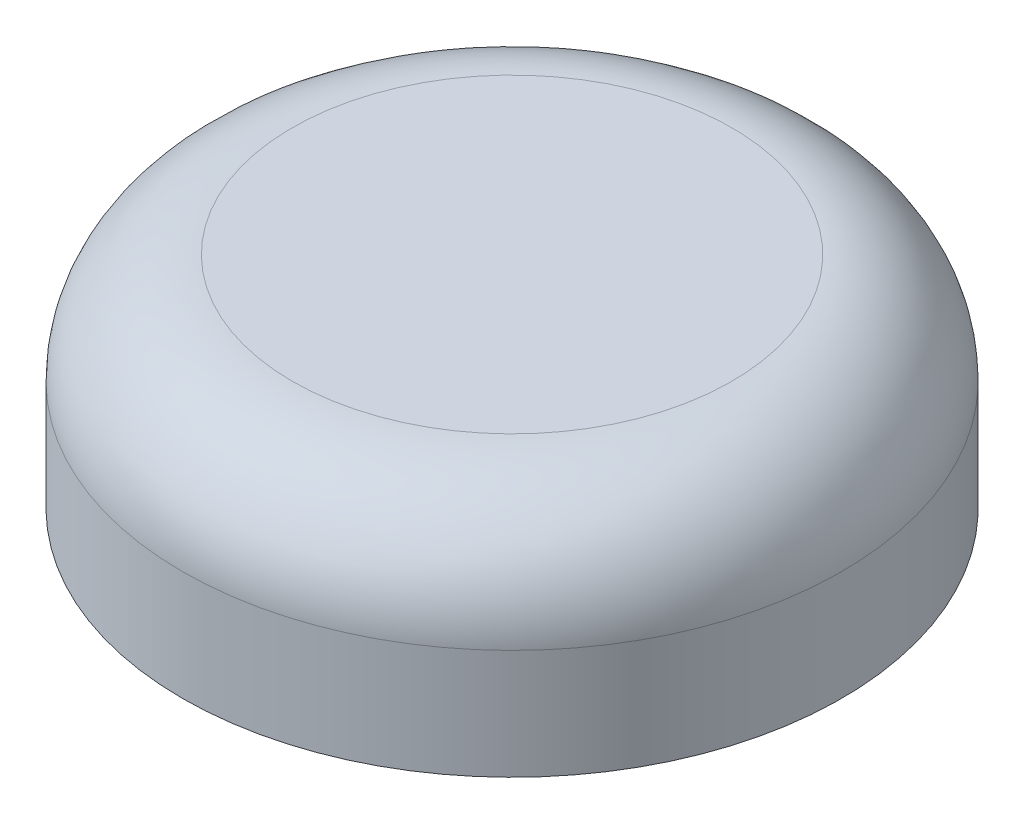
ISO-10303-21;
HEADER;
FILE_DESCRIPTION(('STEP AP214'),'2;1');
FILE_NAME('part.step','',(''),(''),'','','');
FILE_SCHEMA(('AUTOMOTIVE_DESIGN { 1 0 10303 214 1 1 1 1 }'));
ENDSEC;
DATA;
#1=APPLICATION_CONTEXT('core data for automotive mechanical design processes');
#2=APPLICATION_PROTOCOL_DEFINITION('international standard','automotive_design',2000,#1);
#3=PRODUCT_CONTEXT('',#1,'mechanical');
#4=PRODUCT('Part','Part','',(#3));
#5=PRODUCT_RELATED_PRODUCT_CATEGORY('part','',(#4));
#6=PRODUCT_DEFINITION_FORMATION('','',#4);
#7=PRODUCT_DEFINITION_CONTEXT('part definition',#1,'design');
#8=PRODUCT_DEFINITION('design','',#6,#7);
#9=PRODUCT_DEFINITION_SHAPE('','',#8);
#10=(LENGTH_UNIT() NAMED_UNIT(*) SI_UNIT(.MILLI.,.METRE.));
#11=(NAMED_UNIT(*) PLANE_ANGLE_UNIT() SI_UNIT($,.RADIAN.));
#12=(NAMED_UNIT(*) SI_UNIT($,.STERADIAN.) SOLID_ANGLE_UNIT());
#13=UNCERTAINTY_MEASURE_WITH_UNIT(LENGTH_MEASURE(1.E-05),#10,'distance_accuracy_value','');
#14=(GEOMETRIC_REPRESENTATION_CONTEXT(3) GLOBAL_UNCERTAINTY_ASSIGNED_CONTEXT((#13)) GLOBAL_UNIT_ASSIGNED_CONTEXT((#10,
#11,#12)) REPRESENTATION_CONTEXT('',''));
#15=CARTESIAN_POINT('',(0.,0.,0.));
#16=DIRECTION('',(0.,0.,1.));
#17=DIRECTION('',(1.,0.,0.));
#18=AXIS2_PLACEMENT_3D('',#15,#16,#17);
#19=CARTESIAN_POINT('',(0.,10.,0.));
#20=DIRECTION('',(0.,-1.,0.));
#21=DIRECTION('',(0.,0.,-1.));
#22=AXIS2_PLACEMENT_3D('',#19,#20,#21);
#23=CYLINDRICAL_SURFACE('',#22,25.);
#24=CARTESIAN_POINT('',(0.,0.,0.));
#25=DIRECTION('',(0.,1.,0.));
#26=DIRECTION('',(0.,0.,1.));
#27=AXIS2_PLACEMENT_3D('',#24,#25,#26);
#28=CIRCLE('',#27,25.);
#29=CARTESIAN_POINT('',(-2.5,0.,-24.8746859276655));
#30=VERTEX_POINT('',#29);
#31=CARTESIAN_POINT('',(2.5,0.,-24.8746859276655));
#32=VERTEX_POINT('',#31);
#33=EDGE_CURVE('E99',#30,#32,#28,.T.);
#34=ORIENTED_EDGE('',*,*,#33,.F.);
#35=DIRECTION('',(0.,-1.,0.));
#36=VECTOR('',#35,1.);
#37=CARTESIAN_POINT('',(-2.5,10.,-24.8746859276655));
#38=LINE('',#37,#36);
#39=CARTESIAN_POINT('',(-2.5,10.,-24.8746859276655));
#40=VERTEX_POINT('',#39);
#41=EDGE_CURVE('E117',#40,#30,#38,.T.);
#42=ORIENTED_EDGE('',*,*,#41,.F.);
#43=CARTESIAN_POINT('',(0.,10.,0.));
#44=DIRECTION('',(0.,1.,0.));
#45=DIRECTION('',(0.,0.,1.));
#46=AXIS2_PLACEMENT_3D('',#43,#44,#45);
#47=CIRCLE('',#46,25.);
#48=CARTESIAN_POINT('',(2.5,10.,-24.8746859276655));
#49=VERTEX_POINT('',#48);
#50=EDGE_CURVE('E112',#40,#49,#47,.T.);
#51=ORIENTED_EDGE('',*,*,#50,.T.);
#52=DIRECTION('',(0.,-1.,0.));
#53=VECTOR('',#52,1.);
#54=CARTESIAN_POINT('',(2.5,10.,-24.8746859276655));
#55=LINE('',#54,#53);
#56=EDGE_CURVE('E83',#49,#32,#55,.T.);
#57=ORIENTED_EDGE('',*,*,#56,.T.);
#58=EDGE_LOOP('',(#34,#42,#51,#57));
#59=FACE_BOUND('',#58,.T.);
#60=ADVANCED_FACE('F39',(#59),#23,.F.);
#61=CARTESIAN_POINT('',(-2.5,10.,0.));
#62=DIRECTION('',(1.,0.,0.));
#63=DIRECTION('',(0.,0.,-1.));
#64=AXIS2_PLACEMENT_3D('',#61,#62,#63);
#65=PLANE('',#64);
#66=DIRECTION('',(0.,0.,1.));
#67=VECTOR('',#66,1.);
#68=CARTESIAN_POINT('',(-2.5,0.,0.));
#69=LINE('',#68,#67);
#70=CARTESIAN_POINT('',(-2.5,0.,-19.8431348329844));
#71=VERTEX_POINT('',#70);
#72=EDGE_CURVE('E93',#30,#71,#69,.T.);
#73=ORIENTED_EDGE('',*,*,#72,.T.);
#74=DIRECTION('',(0.,-1.,0.));
#75=VECTOR('',#74,1.);
#76=CARTESIAN_POINT('',(-2.5,10.,-19.8431348329844));
#77=LINE('',#76,#75);
#78=CARTESIAN_POINT('',(-2.5,10.,-19.8431348329844));
#79=VERTEX_POINT('',#78);
#80=EDGE_CURVE('E82',#79,#71,#77,.T.);
#81=ORIENTED_EDGE('',*,*,#80,.F.);
#82=DIRECTION('',(0.,0.,1.));
#83=VECTOR('',#82,1.);
#84=CARTESIAN_POINT('',(-2.5,10.,0.));
#85=LINE('',#84,#83);
#86=EDGE_CURVE('E167',#40,#79,#85,.T.);
#87=ORIENTED_EDGE('',*,*,#86,.F.);
#88=ORIENTED_EDGE('',*,*,#41,.T.);
#89=EDGE_LOOP('',(#73,#81,#87,#88));
#90=FACE_BOUND('',#89,.T.);
#91=ADVANCED_FACE('F134',(#90),#65,.F.);
#92=CARTESIAN_POINT('',(0.,10.,0.));
#93=DIRECTION('',(0.,-1.,0.));
#94=DIRECTION('',(0.,0.,-1.));
#95=AXIS2_PLACEMENT_3D('',#92,#93,#94);
#96=CYLINDRICAL_SURFACE('',#95,20.);
#97=CARTESIAN_POINT('',(0.,0.,0.));
#98=DIRECTION('',(0.,1.,0.));
#99=DIRECTION('',(0.,0.,1.));
#100=AXIS2_PLACEMENT_3D('',#97,#98,#99);
#101=CIRCLE('',#100,20.);
#102=CARTESIAN_POINT('',(2.5,0.,-19.8431348329844));
#103=VERTEX_POINT('',#102);
#104=EDGE_CURVE('E87',#71,#103,#101,.T.);
#105=ORIENTED_EDGE('',*,*,#104,.T.);
#106=DIRECTION('',(0.,-1.,0.));
#107=VECTOR('',#106,1.);
#108=CARTESIAN_POINT('',(2.5,10.,-19.8431348329844));
#109=LINE('',#108,#107);
#110=CARTESIAN_POINT('',(2.5,10.,-19.8431348329844));
#111=VERTEX_POINT('',#110);
#112=EDGE_CURVE('E73',#111,#103,#109,.T.);
#113=ORIENTED_EDGE('',*,*,#112,.F.);
#114=CARTESIAN_POINT('',(0.,10.,0.));
#115=DIRECTION('',(0.,1.,0.));
#116=DIRECTION('',(0.,0.,1.));
#117=AXIS2_PLACEMENT_3D('',#114,#115,#116);
#118=CIRCLE('',#117,20.);
#119=EDGE_CURVE('E56',#79,#111,#118,.T.);
#120=ORIENTED_EDGE('',*,*,#119,.F.);
#121=ORIENTED_EDGE('',*,*,#80,.T.);
#122=EDGE_LOOP('',(#105,#113,#120,#121));
#123=FACE_BOUND('',#122,.T.);
#124=ADVANCED_FACE('F88',(#123),#96,.T.);
#125=CARTESIAN_POINT('',(0.,10.,0.));
#126=DIRECTION('',(0.,-1.,0.));
#127=DIRECTION('',(0.,0.,-1.));
#128=AXIS2_PLACEMENT_3D('',#125,#126,#127);
#129=CYLINDRICAL_SURFACE('',#128,15.);
#130=CARTESIAN_POINT('',(0.,10.,0.));
#131=DIRECTION('',(0.,1.,0.));
#132=DIRECTION('',(0.,0.,1.));
#133=AXIS2_PLACEMENT_3D('',#130,#131,#132);
#134=CIRCLE('',#133,15.);
#135=CARTESIAN_POINT('',(0.,10.,15.));
#136=VERTEX_POINT('',#135);
#137=EDGE_CURVE('E178',#136,#136,#134,.T.);
#138=ORIENTED_EDGE('',*,*,#137,.T.);
#139=EDGE_LOOP('',(#138));
#140=FACE_BOUND('',#139,.T.);
#141=CARTESIAN_POINT('',(0.,0.,0.));
#142=DIRECTION('',(0.,1.,0.));
#143=DIRECTION('',(0.,0.,1.));
#144=AXIS2_PLACEMENT_3D('',#141,#142,#143);
#145=CIRCLE('',#144,15.);
#146=CARTESIAN_POINT('',(0.,0.,15.));
#147=VERTEX_POINT('',#146);
#148=EDGE_CURVE('E101',#147,#147,#145,.T.);
#149=ORIENTED_EDGE('',*,*,#148,.F.);
#150=EDGE_LOOP('',(#149));
#151=FACE_BOUND('',#150,.T.);
#152=ADVANCED_FACE('F144',(#140,#151),#129,.F.);
#153=CARTESIAN_POINT('',(2.5,10.,0.));
#154=DIRECTION('',(1.,0.,0.));
#155=DIRECTION('',(0.,0.,-1.));
#156=AXIS2_PLACEMENT_3D('',#153,#154,#155);
#157=PLANE('',#156);
#158=DIRECTION('',(0.,0.,1.));
#159=VECTOR('',#158,1.);
#160=CARTESIAN_POINT('',(2.5,0.,0.));
#161=LINE('',#160,#159);
#162=EDGE_CURVE('E78',#32,#103,#161,.T.);
#163=ORIENTED_EDGE('',*,*,#162,.F.);
#164=ORIENTED_EDGE('',*,*,#56,.F.);
#165=DIRECTION('',(0.,0.,1.));
#166=VECTOR('',#165,1.);
#167=CARTESIAN_POINT('',(2.5,10.,0.));
#168=LINE('',#167,#166);
#169=EDGE_CURVE('E79',#49,#111,#168,.T.);
#170=ORIENTED_EDGE('',*,*,#169,.T.);
#171=ORIENTED_EDGE('',*,*,#112,.T.);
#172=EDGE_LOOP('',(#163,#164,#170,#171));
#173=FACE_BOUND('',#172,.T.);
#174=ADVANCED_FACE('F75',(#173),#157,.T.);
#175=CARTESIAN_POINT('',(0.,10.,0.));
#176=DIRECTION('',(0.,-1.,0.));
#177=DIRECTION('',(0.,0.,-1.));
#178=AXIS2_PLACEMENT_3D('',#175,#176,#177);
#179=CYLINDRICAL_SURFACE('',#178,30.);
#180=CARTESIAN_POINT('',(0.,10.,0.));
#181=DIRECTION('',(0.,1.,0.));
#182=DIRECTION('',(0.,0.,1.));
#183=AXIS2_PLACEMENT_3D('',#180,#181,#182);
#184=CIRCLE('',#183,30.);
#185=CARTESIAN_POINT('',(0.,10.,30.));
#186=VERTEX_POINT('',#185);
#187=EDGE_CURVE('E11',#186,#186,#184,.F.);
#188=ORIENTED_EDGE('',*,*,#187,.T.);
#189=EDGE_LOOP('',(#188));
#190=FACE_BOUND('',#189,.T.);
#191=CARTESIAN_POINT('',(0.,0.,0.));
#192=DIRECTION('',(0.,1.,0.));
#193=DIRECTION('',(0.,0.,1.));
#194=AXIS2_PLACEMENT_3D('',#191,#192,#193);
#195=CIRCLE('',#194,30.);
#196=CARTESIAN_POINT('',(0.,0.,30.));
#197=VERTEX_POINT('',#196);
#198=EDGE_CURVE('E105',#197,#197,#195,.T.);
#199=ORIENTED_EDGE('',*,*,#198,.T.);
#200=EDGE_LOOP('',(#199));
#201=FACE_BOUND('',#200,.T.);
#202=ADVANCED_FACE('F147',(#190,#201),#179,.T.);
#203=CARTESIAN_POINT('',(0.,0.,0.));
#204=DIRECTION('',(0.,1.,0.));
#205=DIRECTION('',(0.,0.,1.));
#206=AXIS2_PLACEMENT_3D('',#203,#204,#205);
#207=PLANE('',#206);
#208=ORIENTED_EDGE('',*,*,#33,.T.);
#209=ORIENTED_EDGE('',*,*,#162,.T.);
#210=ORIENTED_EDGE('',*,*,#104,.F.);
#211=ORIENTED_EDGE('',*,*,#72,.F.);
#212=EDGE_LOOP('',(#208,#209,#210,#211));
#213=FACE_BOUND('',#212,.T.);
#214=ORIENTED_EDGE('',*,*,#148,.T.);
#215=EDGE_LOOP('',(#214));
#216=FACE_BOUND('',#215,.T.);
#217=ORIENTED_EDGE('',*,*,#198,.F.);
#218=EDGE_LOOP('',(#217));
#219=FACE_BOUND('',#218,.T.);
#220=ADVANCED_FACE('F96',(#213,#216,#219),#207,.F.);
#221=CARTESIAN_POINT('',(0.,10.,0.));
#222=DIRECTION('',(0.,1.,0.));
#223=DIRECTION('',(0.,0.,1.));
#224=AXIS2_PLACEMENT_3D('',#221,#222,#223);
#225=PLANE('',#224);
#226=ORIENTED_EDGE('',*,*,#137,.F.);
#227=EDGE_LOOP('',(#226));
#228=FACE_BOUND('',#227,.T.);
#229=ADVANCED_FACE('F156',(#228),#225,.F.);
#230=ORIENTED_EDGE('',*,*,#50,.F.);
#231=ORIENTED_EDGE('',*,*,#86,.T.);
#232=ORIENTED_EDGE('',*,*,#119,.T.);
#233=ORIENTED_EDGE('',*,*,#169,.F.);
#234=EDGE_LOOP('',(#230,#231,#232,#233));
#235=FACE_BOUND('',#234,.T.);
#236=ADVANCED_FACE('F130',(#235),#225,.F.);
#237=CARTESIAN_POINT('',(0.,20.,0.));
#238=DIRECTION('',(0.,1.,0.));
#239=DIRECTION('',(0.,0.,1.));
#240=AXIS2_PLACEMENT_3D('',#237,#238,#239);
#241=PLANE('',#240);
#242=CARTESIAN_POINT('',(0.,20.,0.));
#243=DIRECTION('',(0.,1.,0.));
#244=DIRECTION('',(0.,0.,1.));
#245=AXIS2_PLACEMENT_3D('',#242,#243,#244);
#246=CIRCLE('',#245,20.);
#247=CARTESIAN_POINT('',(0.,20.,20.));
#248=VERTEX_POINT('',#247);
#249=EDGE_CURVE('E49',#248,#248,#246,.T.);
#250=ORIENTED_EDGE('',*,*,#249,.T.);
#251=EDGE_LOOP('',(#250));
#252=FACE_BOUND('',#251,.T.);
#253=ADVANCED_FACE('F123',(#252),#241,.T.);
#254=CARTESIAN_POINT('',(0.,10.,0.));
#255=DIRECTION('',(0.,1.,0.));
#256=DIRECTION('',(0.,0.,1.));
#257=AXIS2_PLACEMENT_3D('',#254,#255,#256);
#258=TOROIDAL_SURFACE('',#257,20.,10.);
#259=ORIENTED_EDGE('',*,*,#187,.F.);
#260=EDGE_LOOP('',(#259));
#261=FACE_BOUND('',#260,.T.);
#262=ORIENTED_EDGE('',*,*,#249,.F.);
#263=EDGE_LOOP('',(#262));
#264=FACE_BOUND('',#263,.T.);
#265=ADVANCED_FACE('F41',(#261,#264),#258,.T.);
#266=CLOSED_SHELL('',(#60,#91,#124,#152,#174,#202,#220,#229,#236,#253,#265));
#267=MANIFOLD_SOLID_BREP('B2',#266);
#268=ADVANCED_BREP_SHAPE_REPRESENTATION('',(#18,#267),#14);
#269=SHAPE_DEFINITION_REPRESENTATION(#9,#268);
ENDSEC;
END-ISO-10303-21;
